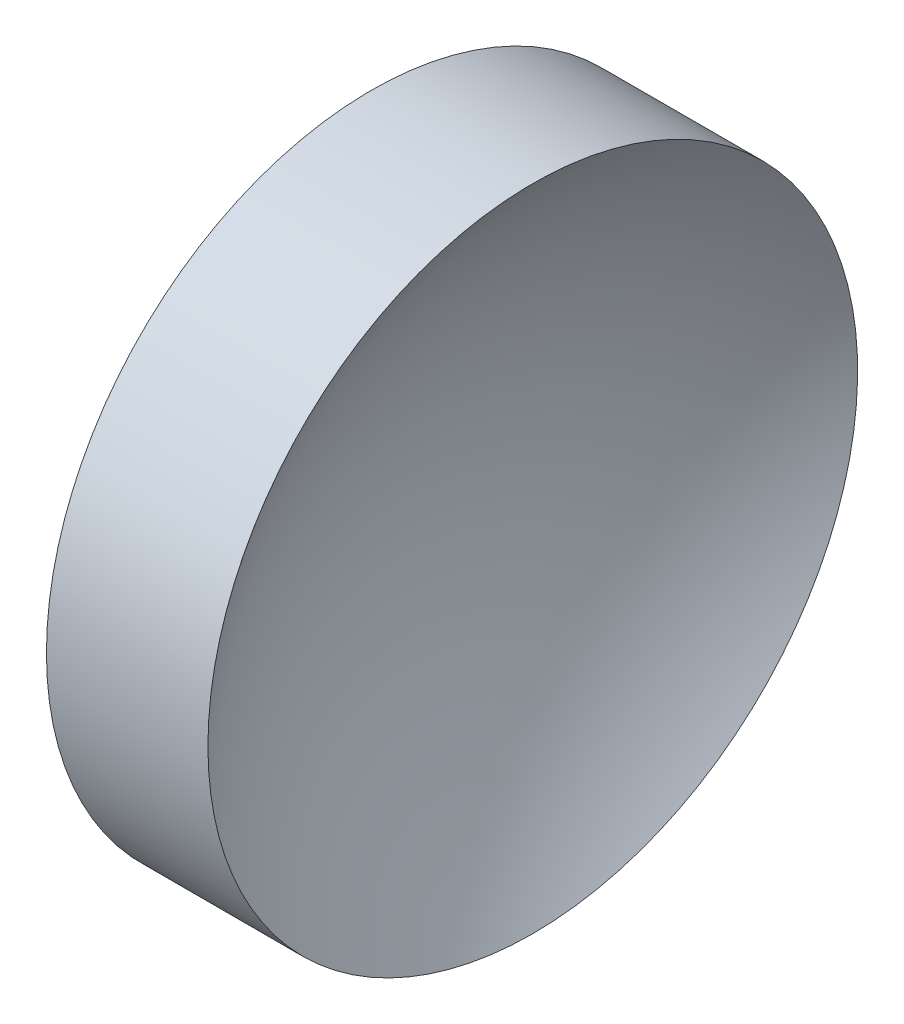
ISO-10303-21;
HEADER;
FILE_DESCRIPTION(('STEP AP214'),'2;1');
FILE_NAME('part.step','',(''),(''),'','','');
FILE_SCHEMA(('AUTOMOTIVE_DESIGN { 1 0 10303 214 1 1 1 1 }'));
ENDSEC;
DATA;
#1=APPLICATION_CONTEXT('core data for automotive mechanical design processes');
#2=APPLICATION_PROTOCOL_DEFINITION('international standard','automotive_design',2000,#1);
#3=PRODUCT_CONTEXT('',#1,'mechanical');
#4=PRODUCT('Part','Part','',(#3));
#5=PRODUCT_RELATED_PRODUCT_CATEGORY('part','',(#4));
#6=PRODUCT_DEFINITION_FORMATION('','',#4);
#7=PRODUCT_DEFINITION_CONTEXT('part definition',#1,'design');
#8=PRODUCT_DEFINITION('design','',#6,#7);
#9=PRODUCT_DEFINITION_SHAPE('','',#8);
#10=(LENGTH_UNIT() NAMED_UNIT(*) SI_UNIT(.MILLI.,.METRE.));
#11=(NAMED_UNIT(*) PLANE_ANGLE_UNIT() SI_UNIT($,.RADIAN.));
#12=(NAMED_UNIT(*) SI_UNIT($,.STERADIAN.) SOLID_ANGLE_UNIT());
#13=UNCERTAINTY_MEASURE_WITH_UNIT(LENGTH_MEASURE(1.E-05),#10,'distance_accuracy_value','');
#14=(GEOMETRIC_REPRESENTATION_CONTEXT(3) GLOBAL_UNCERTAINTY_ASSIGNED_CONTEXT((#13)) GLOBAL_UNIT_ASSIGNED_CONTEXT((#10,
#11,#12)) REPRESENTATION_CONTEXT('',''));
#15=CARTESIAN_POINT('',(0.,0.,0.));
#16=DIRECTION('',(0.,0.,1.));
#17=DIRECTION('',(1.,0.,0.));
#18=AXIS2_PLACEMENT_3D('',#15,#16,#17);
#19=CARTESIAN_POINT('',(80.1823370525261,32.6107681292268,0.));
#20=DIRECTION('',(-1.,0.,0.));
#21=DIRECTION('',(0.,-1.,0.));
#22=AXIS2_PLACEMENT_3D('',#19,#20,#21);
#23=SPHERICAL_SURFACE('',#22,20.65);
#24=CARTESIAN_POINT('',(63.7454121576439,32.6107681292268,0.));
#25=DIRECTION('',(-1.,0.,0.));
#26=DIRECTION('',(0.,0.,1.));
#27=AXIS2_PLACEMENT_3D('',#24,#25,#26);
#28=CIRCLE('',#27,12.5);
#29=CARTESIAN_POINT('',(63.7454121576439,32.6107681292268,12.5));
#30=VERTEX_POINT('',#29);
#31=EDGE_CURVE('E10',#30,#30,#28,.T.);
#32=ORIENTED_EDGE('',*,*,#31,.F.);
#33=EDGE_LOOP('',(#32));
#34=FACE_BOUND('',#33,.T.);
#35=ADVANCED_FACE('F35',(#34),#23,.F.);
#36=CARTESIAN_POINT('',(56.1009150799972,32.6107681292268,0.));
#37=DIRECTION('',(-1.,0.,0.));
#38=DIRECTION('',(0.,0.,1.));
#39=AXIS2_PLACEMENT_3D('',#36,#37,#38);
#40=CYLINDRICAL_SURFACE('',#39,12.5);
#41=CARTESIAN_POINT('',(57.5323370525261,32.6107681292268,0.));
#42=DIRECTION('',(-1.,0.,0.));
#43=DIRECTION('',(0.,0.,1.));
#44=AXIS2_PLACEMENT_3D('',#41,#42,#43);
#45=CIRCLE('',#44,12.5);
#46=CARTESIAN_POINT('',(57.5323370525261,32.6107681292268,12.5));
#47=VERTEX_POINT('',#46);
#48=EDGE_CURVE('E41',#47,#47,#45,.T.);
#49=ORIENTED_EDGE('',*,*,#48,.F.);
#50=EDGE_LOOP('',(#49));
#51=FACE_BOUND('',#50,.T.);
#52=ORIENTED_EDGE('',*,*,#31,.T.);
#53=EDGE_LOOP('',(#52));
#54=FACE_BOUND('',#53,.T.);
#55=ADVANCED_FACE('F49',(#51,#54),#40,.T.);
#56=CARTESIAN_POINT('',(57.5323370525261,32.6107681292268,0.));
#57=DIRECTION('',(1.,0.,0.));
#58=DIRECTION('',(0.,0.,-1.));
#59=AXIS2_PLACEMENT_3D('',#56,#57,#58);
#60=PLANE('',#59);
#61=ORIENTED_EDGE('',*,*,#48,.T.);
#62=EDGE_LOOP('',(#61));
#63=FACE_BOUND('',#62,.T.);
#64=ADVANCED_FACE('F47',(#63),#60,.F.);
#65=CLOSED_SHELL('',(#35,#55,#64));
#66=MANIFOLD_SOLID_BREP('B2',#65);
#67=ADVANCED_BREP_SHAPE_REPRESENTATION('',(#18,#66),#14);
#68=SHAPE_DEFINITION_REPRESENTATION(#9,#67);
ENDSEC;
END-ISO-10303-21;
